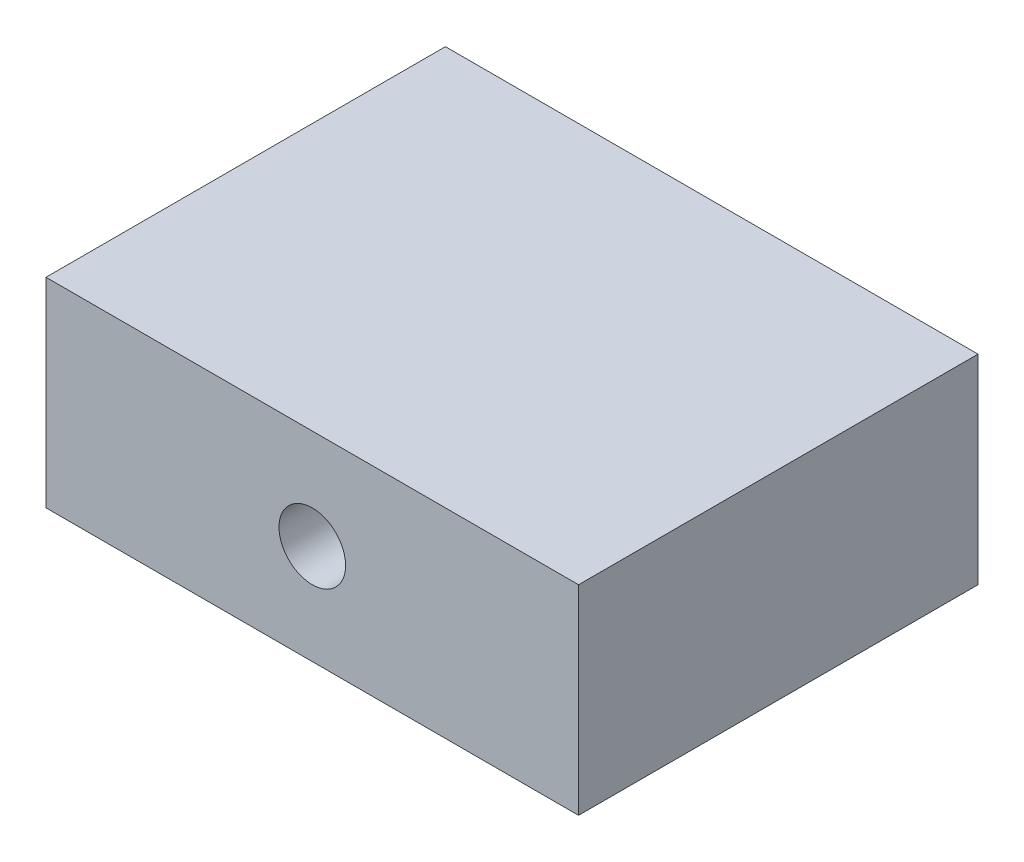
ISO-10303-21;
HEADER;
FILE_DESCRIPTION(('STEP AP214'),'2;1');
FILE_NAME('part.step','',(''),(''),'','','');
FILE_SCHEMA(('AUTOMOTIVE_DESIGN { 1 0 10303 214 1 1 1 1 }'));
ENDSEC;
DATA;
#1=APPLICATION_CONTEXT('core data for automotive mechanical design processes');
#2=APPLICATION_PROTOCOL_DEFINITION('international standard','automotive_design',2000,#1);
#3=PRODUCT_CONTEXT('',#1,'mechanical');
#4=PRODUCT('Part','Part','',(#3));
#5=PRODUCT_RELATED_PRODUCT_CATEGORY('part','',(#4));
#6=PRODUCT_DEFINITION_FORMATION('','',#4);
#7=PRODUCT_DEFINITION_CONTEXT('part definition',#1,'design');
#8=PRODUCT_DEFINITION('design','',#6,#7);
#9=PRODUCT_DEFINITION_SHAPE('','',#8);
#10=(LENGTH_UNIT() NAMED_UNIT(*) SI_UNIT(.MILLI.,.METRE.));
#11=(NAMED_UNIT(*) PLANE_ANGLE_UNIT() SI_UNIT($,.RADIAN.));
#12=(NAMED_UNIT(*) SI_UNIT($,.STERADIAN.) SOLID_ANGLE_UNIT());
#13=UNCERTAINTY_MEASURE_WITH_UNIT(LENGTH_MEASURE(1.E-05),#10,'distance_accuracy_value','');
#14=(GEOMETRIC_REPRESENTATION_CONTEXT(3) GLOBAL_UNCERTAINTY_ASSIGNED_CONTEXT((#13)) GLOBAL_UNIT_ASSIGNED_CONTEXT((#10,
#11,#12)) REPRESENTATION_CONTEXT('',''));
#15=CARTESIAN_POINT('',(0.,0.,0.));
#16=DIRECTION('',(0.,0.,1.));
#17=DIRECTION('',(1.,0.,0.));
#18=AXIS2_PLACEMENT_3D('',#15,#16,#17);
#19=CARTESIAN_POINT('',(40.,30.,-30.));
#20=DIRECTION('',(-1.,0.,0.));
#21=DIRECTION('',(0.,0.,1.));
#22=AXIS2_PLACEMENT_3D('',#19,#20,#21);
#23=PLANE('',#22);
#24=DIRECTION('',(0.,0.,-1.));
#25=VECTOR('',#24,1.);
#26=CARTESIAN_POINT('',(40.,0.,-30.));
#27=LINE('',#26,#25);
#28=CARTESIAN_POINT('',(40.,0.,30.));
#29=VERTEX_POINT('',#28);
#30=CARTESIAN_POINT('',(40.,0.,-30.));
#31=VERTEX_POINT('',#30);
#32=EDGE_CURVE('E101',#29,#31,#27,.T.);
#33=ORIENTED_EDGE('',*,*,#32,.T.);
#34=DIRECTION('',(0.,-1.,0.));
#35=VECTOR('',#34,1.);
#36=CARTESIAN_POINT('',(40.,30.,-30.));
#37=LINE('',#36,#35);
#38=CARTESIAN_POINT('',(40.,30.,-30.));
#39=VERTEX_POINT('',#38);
#40=EDGE_CURVE('E11',#39,#31,#37,.T.);
#41=ORIENTED_EDGE('',*,*,#40,.F.);
#42=DIRECTION('',(0.,0.,-1.));
#43=VECTOR('',#42,1.);
#44=CARTESIAN_POINT('',(40.,30.,-30.));
#45=LINE('',#44,#43);
#46=CARTESIAN_POINT('',(40.,30.,30.));
#47=VERTEX_POINT('',#46);
#48=EDGE_CURVE('E89',#47,#39,#45,.T.);
#49=ORIENTED_EDGE('',*,*,#48,.F.);
#50=DIRECTION('',(0.,-1.,0.));
#51=VECTOR('',#50,1.);
#52=CARTESIAN_POINT('',(40.,30.,30.));
#53=LINE('',#52,#51);
#54=EDGE_CURVE('E97',#47,#29,#53,.T.);
#55=ORIENTED_EDGE('',*,*,#54,.T.);
#56=EDGE_LOOP('',(#33,#41,#49,#55));
#57=FACE_BOUND('',#56,.T.);
#58=ADVANCED_FACE('F38',(#57),#23,.F.);
#59=CARTESIAN_POINT('',(-40.,30.,-30.));
#60=DIRECTION('',(0.,0.,1.));
#61=DIRECTION('',(1.,0.,0.));
#62=AXIS2_PLACEMENT_3D('',#59,#60,#61);
#63=PLANE('',#62);
#64=CARTESIAN_POINT('',(0.,15.,-30.));
#65=DIRECTION('',(0.,0.,1.));
#66=DIRECTION('',(1.,0.,0.));
#67=AXIS2_PLACEMENT_3D('',#64,#65,#66);
#68=CIRCLE('',#67,5.);
#69=CARTESIAN_POINT('',(4.99999999999999,15.,-30.));
#70=VERTEX_POINT('',#69);
#71=EDGE_CURVE('E104',#70,#70,#68,.T.);
#72=ORIENTED_EDGE('',*,*,#71,.T.);
#73=EDGE_LOOP('',(#72));
#74=FACE_BOUND('',#73,.T.);
#75=DIRECTION('',(-1.,0.,0.));
#76=VECTOR('',#75,1.);
#77=CARTESIAN_POINT('',(-40.,0.,-30.));
#78=LINE('',#77,#76);
#79=CARTESIAN_POINT('',(-40.,0.,-30.));
#80=VERTEX_POINT('',#79);
#81=EDGE_CURVE('E93',#31,#80,#78,.T.);
#82=ORIENTED_EDGE('',*,*,#81,.T.);
#83=DIRECTION('',(0.,-1.,0.));
#84=VECTOR('',#83,1.);
#85=CARTESIAN_POINT('',(-40.,30.,-30.));
#86=LINE('',#85,#84);
#87=CARTESIAN_POINT('',(-40.,30.,-30.));
#88=VERTEX_POINT('',#87);
#89=EDGE_CURVE('E46',#88,#80,#86,.T.);
#90=ORIENTED_EDGE('',*,*,#89,.F.);
#91=DIRECTION('',(-1.,0.,0.));
#92=VECTOR('',#91,1.);
#93=CARTESIAN_POINT('',(-40.,30.,-30.));
#94=LINE('',#93,#92);
#95=EDGE_CURVE('E84',#39,#88,#94,.T.);
#96=ORIENTED_EDGE('',*,*,#95,.F.);
#97=ORIENTED_EDGE('',*,*,#40,.T.);
#98=EDGE_LOOP('',(#82,#90,#96,#97));
#99=FACE_BOUND('',#98,.T.);
#100=ADVANCED_FACE('F92',(#74,#99),#63,.F.);
#101=CARTESIAN_POINT('',(-40.,30.,-30.));
#102=DIRECTION('',(1.,0.,0.));
#103=DIRECTION('',(0.,0.,-1.));
#104=AXIS2_PLACEMENT_3D('',#101,#102,#103);
#105=PLANE('',#104);
#106=DIRECTION('',(0.,0.,1.));
#107=VECTOR('',#106,1.);
#108=CARTESIAN_POINT('',(-40.,0.,-30.));
#109=LINE('',#108,#107);
#110=CARTESIAN_POINT('',(-40.,0.,30.));
#111=VERTEX_POINT('',#110);
#112=EDGE_CURVE('E71',#80,#111,#109,.T.);
#113=ORIENTED_EDGE('',*,*,#112,.T.);
#114=DIRECTION('',(0.,-1.,0.));
#115=VECTOR('',#114,1.);
#116=CARTESIAN_POINT('',(-40.,30.,30.));
#117=LINE('',#116,#115);
#118=CARTESIAN_POINT('',(-40.,30.,30.));
#119=VERTEX_POINT('',#118);
#120=EDGE_CURVE('E94',#119,#111,#117,.T.);
#121=ORIENTED_EDGE('',*,*,#120,.F.);
#122=DIRECTION('',(0.,0.,1.));
#123=VECTOR('',#122,1.);
#124=CARTESIAN_POINT('',(-40.,30.,-30.));
#125=LINE('',#124,#123);
#126=EDGE_CURVE('E87',#88,#119,#125,.T.);
#127=ORIENTED_EDGE('',*,*,#126,.F.);
#128=ORIENTED_EDGE('',*,*,#89,.T.);
#129=EDGE_LOOP('',(#113,#121,#127,#128));
#130=FACE_BOUND('',#129,.T.);
#131=ADVANCED_FACE('F95',(#130),#105,.F.);
#132=CARTESIAN_POINT('',(-40.,30.,30.));
#133=DIRECTION('',(0.,0.,-1.));
#134=DIRECTION('',(-1.,0.,0.));
#135=AXIS2_PLACEMENT_3D('',#132,#133,#134);
#136=PLANE('',#135);
#137=CARTESIAN_POINT('',(0.,15.,30.));
#138=DIRECTION('',(0.,0.,1.));
#139=DIRECTION('',(1.,0.,0.));
#140=AXIS2_PLACEMENT_3D('',#137,#138,#139);
#141=CIRCLE('',#140,5.);
#142=CARTESIAN_POINT('',(4.99999999999999,15.,30.));
#143=VERTEX_POINT('',#142);
#144=EDGE_CURVE('E115',#143,#143,#141,.T.);
#145=ORIENTED_EDGE('',*,*,#144,.F.);
#146=EDGE_LOOP('',(#145));
#147=FACE_BOUND('',#146,.T.);
#148=DIRECTION('',(1.,0.,0.));
#149=VECTOR('',#148,1.);
#150=CARTESIAN_POINT('',(-40.,0.,30.));
#151=LINE('',#150,#149);
#152=EDGE_CURVE('E77',#111,#29,#151,.T.);
#153=ORIENTED_EDGE('',*,*,#152,.T.);
#154=ORIENTED_EDGE('',*,*,#54,.F.);
#155=DIRECTION('',(1.,0.,0.));
#156=VECTOR('',#155,1.);
#157=CARTESIAN_POINT('',(-40.,30.,30.));
#158=LINE('',#157,#156);
#159=EDGE_CURVE('E54',#119,#47,#158,.T.);
#160=ORIENTED_EDGE('',*,*,#159,.F.);
#161=ORIENTED_EDGE('',*,*,#120,.T.);
#162=EDGE_LOOP('',(#153,#154,#160,#161));
#163=FACE_BOUND('',#162,.T.);
#164=ADVANCED_FACE('F109',(#147,#163),#136,.F.);
#165=CARTESIAN_POINT('',(0.,30.,0.));
#166=DIRECTION('',(0.,1.,0.));
#167=DIRECTION('',(0.,0.,1.));
#168=AXIS2_PLACEMENT_3D('',#165,#166,#167);
#169=PLANE('',#168);
#170=ORIENTED_EDGE('',*,*,#48,.T.);
#171=ORIENTED_EDGE('',*,*,#95,.T.);
#172=ORIENTED_EDGE('',*,*,#126,.T.);
#173=ORIENTED_EDGE('',*,*,#159,.T.);
#174=EDGE_LOOP('',(#170,#171,#172,#173));
#175=FACE_BOUND('',#174,.T.);
#176=ADVANCED_FACE('F85',(#175),#169,.T.);
#177=CARTESIAN_POINT('',(0.,0.,0.));
#178=DIRECTION('',(0.,1.,0.));
#179=DIRECTION('',(0.,0.,1.));
#180=AXIS2_PLACEMENT_3D('',#177,#178,#179);
#181=PLANE('',#180);
#182=ORIENTED_EDGE('',*,*,#32,.F.);
#183=ORIENTED_EDGE('',*,*,#152,.F.);
#184=ORIENTED_EDGE('',*,*,#112,.F.);
#185=ORIENTED_EDGE('',*,*,#81,.F.);
#186=EDGE_LOOP('',(#182,#183,#184,#185));
#187=FACE_BOUND('',#186,.T.);
#188=ADVANCED_FACE('F112',(#187),#181,.F.);
#189=CARTESIAN_POINT('',(0.,15.,-30.));
#190=DIRECTION('',(0.,0.,1.));
#191=DIRECTION('',(1.,0.,0.));
#192=AXIS2_PLACEMENT_3D('',#189,#190,#191);
#193=CYLINDRICAL_SURFACE('',#192,5.);
#194=ORIENTED_EDGE('',*,*,#71,.F.);
#195=EDGE_LOOP('',(#194));
#196=FACE_BOUND('',#195,.T.);
#197=ORIENTED_EDGE('',*,*,#144,.T.);
#198=EDGE_LOOP('',(#197));
#199=FACE_BOUND('',#198,.T.);
#200=ADVANCED_FACE('F122',(#196,#199),#193,.F.);
#201=CLOSED_SHELL('',(#58,#100,#131,#164,#176,#188,#200));
#202=MANIFOLD_SOLID_BREP('B2',#201);
#203=ADVANCED_BREP_SHAPE_REPRESENTATION('',(#18,#202),#14);
#204=SHAPE_DEFINITION_REPRESENTATION(#9,#203);
ENDSEC;
END-ISO-10303-21;
